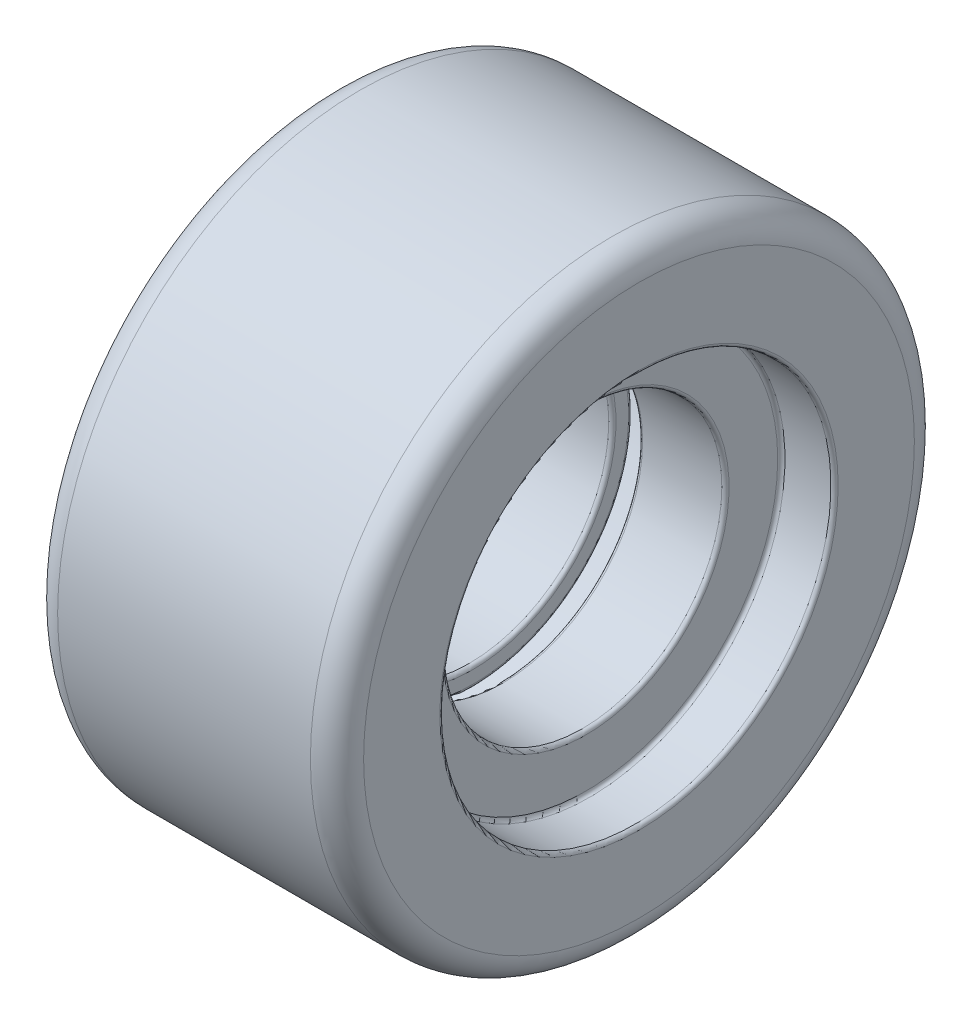
ISO-10303-21;
HEADER;
FILE_DESCRIPTION(('STEP AP214'),'2;1');
FILE_NAME('part.step','',(''),(''),'','','');
FILE_SCHEMA(('AUTOMOTIVE_DESIGN { 1 0 10303 214 1 1 1 1 }'));
ENDSEC;
DATA;
#1=APPLICATION_CONTEXT('core data for automotive mechanical design processes');
#2=APPLICATION_PROTOCOL_DEFINITION('international standard','automotive_design',2000,#1);
#3=PRODUCT_CONTEXT('',#1,'mechanical');
#4=PRODUCT('Part','Part','',(#3));
#5=PRODUCT_RELATED_PRODUCT_CATEGORY('part','',(#4));
#6=PRODUCT_DEFINITION_FORMATION('','',#4);
#7=PRODUCT_DEFINITION_CONTEXT('part definition',#1,'design');
#8=PRODUCT_DEFINITION('design','',#6,#7);
#9=PRODUCT_DEFINITION_SHAPE('','',#8);
#10=(LENGTH_UNIT() NAMED_UNIT(*) SI_UNIT(.MILLI.,.METRE.));
#11=(NAMED_UNIT(*) PLANE_ANGLE_UNIT() SI_UNIT($,.RADIAN.));
#12=(NAMED_UNIT(*) SI_UNIT($,.STERADIAN.) SOLID_ANGLE_UNIT());
#13=UNCERTAINTY_MEASURE_WITH_UNIT(LENGTH_MEASURE(1.E-05),#10,'distance_accuracy_value','');
#14=(GEOMETRIC_REPRESENTATION_CONTEXT(3) GLOBAL_UNCERTAINTY_ASSIGNED_CONTEXT((#13)) GLOBAL_UNIT_ASSIGNED_CONTEXT((#10,
#11,#12)) REPRESENTATION_CONTEXT('',''));
#15=CARTESIAN_POINT('',(0.,0.,0.));
#16=DIRECTION('',(0.,0.,1.));
#17=DIRECTION('',(1.,0.,0.));
#18=AXIS2_PLACEMENT_3D('',#15,#16,#17);
#19=CARTESIAN_POINT('',(-75.,107.714767554033,0.));
#20=DIRECTION('',(1.,0.,0.));
#21=DIRECTION('',(0.,0.,-1.));
#22=AXIS2_PLACEMENT_3D('',#19,#20,#21);
#23=PLANE('',#22);
#24=CARTESIAN_POINT('',(-75.,0.,0.));
#25=DIRECTION('',(-1.,0.,0.));
#26=DIRECTION('',(0.,0.,1.));
#27=AXIS2_PLACEMENT_3D('',#24,#25,#26);
#28=CIRCLE('',#27,107.714767554033);
#29=CARTESIAN_POINT('',(-75.,0.,107.714767554033));
#30=VERTEX_POINT('',#29);
#31=EDGE_CURVE('E10',#30,#30,#28,.T.);
#32=ORIENTED_EDGE('',*,*,#31,.F.);
#33=EDGE_LOOP('',(#32));
#34=FACE_BOUND('',#33,.T.);
#35=CARTESIAN_POINT('',(-75.,0.,0.));
#36=DIRECTION('',(-1.,0.,0.));
#37=DIRECTION('',(0.,0.,1.));
#38=AXIS2_PLACEMENT_3D('',#35,#36,#37);
#39=CIRCLE('',#38,147.);
#40=CARTESIAN_POINT('',(-75.,0.,147.));
#41=VERTEX_POINT('',#40);
#42=EDGE_CURVE('E156',#41,#41,#39,.T.);
#43=ORIENTED_EDGE('',*,*,#42,.T.);
#44=EDGE_LOOP('',(#43));
#45=FACE_BOUND('',#44,.T.);
#46=ADVANCED_FACE('F35',(#34,#45),#23,.F.);
#47=CARTESIAN_POINT('',(-72.2852324459665,0.,0.));
#48=DIRECTION('',(-1.,0.,0.));
#49=DIRECTION('',(0.,0.,1.));
#50=AXIS2_PLACEMENT_3D('',#47,#48,#49);
#51=TOROIDAL_SURFACE('',#50,107.714767554033,2.71476755403345);
#52=CARTESIAN_POINT('',(-72.2852324459665,0.,0.));
#53=DIRECTION('',(-1.,0.,0.));
#54=DIRECTION('',(0.,0.,1.));
#55=AXIS2_PLACEMENT_3D('',#52,#53,#54);
#56=CIRCLE('',#55,105.);
#57=CARTESIAN_POINT('',(-72.2852324459665,0.,105.));
#58=VERTEX_POINT('',#57);
#59=EDGE_CURVE('E41',#58,#58,#56,.T.);
#60=ORIENTED_EDGE('',*,*,#59,.F.);
#61=EDGE_LOOP('',(#60));
#62=FACE_BOUND('',#61,.T.);
#63=ORIENTED_EDGE('',*,*,#31,.T.);
#64=EDGE_LOOP('',(#63));
#65=FACE_BOUND('',#64,.T.);
#66=ADVANCED_FACE('F379',(#62,#65),#51,.T.);
#67=CARTESIAN_POINT('',(-91.3698630136986,0.,0.));
#68=DIRECTION('',(-1.,0.,0.));
#69=DIRECTION('',(0.,0.,1.));
#70=AXIS2_PLACEMENT_3D('',#67,#68,#69);
#71=CYLINDRICAL_SURFACE('',#70,105.);
#72=CARTESIAN_POINT('',(-12.7147675540335,0.,0.));
#73=DIRECTION('',(-1.,0.,0.));
#74=DIRECTION('',(0.,0.,1.));
#75=AXIS2_PLACEMENT_3D('',#72,#73,#74);
#76=CIRCLE('',#75,105.);
#77=CARTESIAN_POINT('',(-12.7147675540335,0.,105.));
#78=VERTEX_POINT('',#77);
#79=EDGE_CURVE('E45',#78,#78,#76,.T.);
#80=ORIENTED_EDGE('',*,*,#79,.F.);
#81=EDGE_LOOP('',(#80));
#82=FACE_BOUND('',#81,.T.);
#83=ORIENTED_EDGE('',*,*,#59,.T.);
#84=EDGE_LOOP('',(#83));
#85=FACE_BOUND('',#84,.T.);
#86=ADVANCED_FACE('F374',(#82,#85),#71,.F.);
#87=CARTESIAN_POINT('',(-12.7147675540335,0.,0.));
#88=DIRECTION('',(-1.,0.,0.));
#89=DIRECTION('',(0.,0.,1.));
#90=AXIS2_PLACEMENT_3D('',#87,#88,#89);
#91=TOROIDAL_SURFACE('',#90,107.714767554033,2.71476755403345);
#92=CARTESIAN_POINT('',(-9.99999999999999,0.,0.));
#93=DIRECTION('',(-1.,0.,0.));
#94=DIRECTION('',(0.,0.,1.));
#95=AXIS2_PLACEMENT_3D('',#92,#93,#94);
#96=CIRCLE('',#95,107.714767554033);
#97=CARTESIAN_POINT('',(-9.99999999999999,0.,107.714767554033));
#98=VERTEX_POINT('',#97);
#99=EDGE_CURVE('E49',#98,#98,#96,.T.);
#100=ORIENTED_EDGE('',*,*,#99,.F.);
#101=EDGE_LOOP('',(#100));
#102=FACE_BOUND('',#101,.T.);
#103=ORIENTED_EDGE('',*,*,#79,.T.);
#104=EDGE_LOOP('',(#103));
#105=FACE_BOUND('',#104,.T.);
#106=ADVANCED_FACE('F368',(#102,#105),#91,.T.);
#107=CARTESIAN_POINT('',(-9.99999999999999,117.285232445967,0.));
#108=DIRECTION('',(-1.,0.,0.));
#109=DIRECTION('',(0.,0.,1.));
#110=AXIS2_PLACEMENT_3D('',#107,#108,#109);
#111=PLANE('',#110);
#112=CARTESIAN_POINT('',(-9.99999999999999,0.,0.));
#113=DIRECTION('',(-1.,0.,0.));
#114=DIRECTION('',(0.,0.,1.));
#115=AXIS2_PLACEMENT_3D('',#112,#113,#114);
#116=CIRCLE('',#115,117.285232445967);
#117=CARTESIAN_POINT('',(-9.99999999999999,0.,117.285232445967));
#118=VERTEX_POINT('',#117);
#119=EDGE_CURVE('E54',#118,#118,#116,.T.);
#120=ORIENTED_EDGE('',*,*,#119,.F.);
#121=EDGE_LOOP('',(#120));
#122=FACE_BOUND('',#121,.T.);
#123=ORIENTED_EDGE('',*,*,#99,.T.);
#124=EDGE_LOOP('',(#123));
#125=FACE_BOUND('',#124,.T.);
#126=ADVANCED_FACE('F362',(#122,#125),#111,.F.);
#127=CARTESIAN_POINT('',(-12.7147675540335,0.,0.));
#128=DIRECTION('',(-1.,0.,0.));
#129=DIRECTION('',(0.,0.,1.));
#130=AXIS2_PLACEMENT_3D('',#127,#128,#129);
#131=TOROIDAL_SURFACE('',#130,117.285232445967,2.71476755403345);
#132=CARTESIAN_POINT('',(-12.7147675540335,0.,0.));
#133=DIRECTION('',(-1.,0.,0.));
#134=DIRECTION('',(0.,0.,1.));
#135=AXIS2_PLACEMENT_3D('',#132,#133,#134);
#136=CIRCLE('',#135,120.);
#137=CARTESIAN_POINT('',(-12.7147675540335,0.,120.));
#138=VERTEX_POINT('',#137);
#139=EDGE_CURVE('E57',#138,#138,#136,.T.);
#140=ORIENTED_EDGE('',*,*,#139,.F.);
#141=EDGE_LOOP('',(#140));
#142=FACE_BOUND('',#141,.T.);
#143=ORIENTED_EDGE('',*,*,#119,.T.);
#144=EDGE_LOOP('',(#143));
#145=FACE_BOUND('',#144,.T.);
#146=ADVANCED_FACE('F356',(#142,#145),#131,.T.);
#147=CARTESIAN_POINT('',(-91.3698630136986,0.,0.));
#148=DIRECTION('',(-1.,0.,0.));
#149=DIRECTION('',(0.,0.,1.));
#150=AXIS2_PLACEMENT_3D('',#147,#148,#149);
#151=CYLINDRICAL_SURFACE('',#150,120.);
#152=CARTESIAN_POINT('',(-57.2852324459665,0.,0.));
#153=DIRECTION('',(-1.,0.,0.));
#154=DIRECTION('',(0.,0.,1.));
#155=AXIS2_PLACEMENT_3D('',#152,#153,#154);
#156=CIRCLE('',#155,120.);
#157=CARTESIAN_POINT('',(-57.2852324459665,0.,120.));
#158=VERTEX_POINT('',#157);
#159=EDGE_CURVE('E60',#158,#158,#156,.T.);
#160=ORIENTED_EDGE('',*,*,#159,.F.);
#161=EDGE_LOOP('',(#160));
#162=FACE_BOUND('',#161,.T.);
#163=ORIENTED_EDGE('',*,*,#139,.T.);
#164=EDGE_LOOP('',(#163));
#165=FACE_BOUND('',#164,.T.);
#166=ADVANCED_FACE('F350',(#162,#165),#151,.T.);
#167=CARTESIAN_POINT('',(-57.2852324459665,0.,0.));
#168=DIRECTION('',(-1.,0.,0.));
#169=DIRECTION('',(0.,0.,1.));
#170=AXIS2_PLACEMENT_3D('',#167,#168,#169);
#171=TOROIDAL_SURFACE('',#170,122.714767554033,2.71476755403345);
#172=CARTESIAN_POINT('',(-60.,0.,0.));
#173=DIRECTION('',(-1.,0.,0.));
#174=DIRECTION('',(0.,0.,1.));
#175=AXIS2_PLACEMENT_3D('',#172,#173,#174);
#176=CIRCLE('',#175,122.714767554033);
#177=CARTESIAN_POINT('',(-60.,0.,122.714767554033));
#178=VERTEX_POINT('',#177);
#179=EDGE_CURVE('E63',#178,#178,#176,.T.);
#180=ORIENTED_EDGE('',*,*,#179,.F.);
#181=EDGE_LOOP('',(#180));
#182=FACE_BOUND('',#181,.T.);
#183=ORIENTED_EDGE('',*,*,#159,.T.);
#184=EDGE_LOOP('',(#183));
#185=FACE_BOUND('',#184,.T.);
#186=ADVANCED_FACE('F344',(#182,#185),#171,.F.);
#187=CARTESIAN_POINT('',(-60.,122.714767554033,0.));
#188=DIRECTION('',(-1.,0.,0.));
#189=DIRECTION('',(0.,0.,1.));
#190=AXIS2_PLACEMENT_3D('',#187,#188,#189);
#191=PLANE('',#190);
#192=CARTESIAN_POINT('',(-60.,0.,0.));
#193=DIRECTION('',(-1.,0.,0.));
#194=DIRECTION('',(0.,0.,1.));
#195=AXIS2_PLACEMENT_3D('',#192,#193,#194);
#196=CIRCLE('',#195,159.285232445967);
#197=CARTESIAN_POINT('',(-60.,0.,159.285232445967));
#198=VERTEX_POINT('',#197);
#199=EDGE_CURVE('E66',#198,#198,#196,.T.);
#200=ORIENTED_EDGE('',*,*,#199,.F.);
#201=EDGE_LOOP('',(#200));
#202=FACE_BOUND('',#201,.T.);
#203=ORIENTED_EDGE('',*,*,#179,.T.);
#204=EDGE_LOOP('',(#203));
#205=FACE_BOUND('',#204,.T.);
#206=ADVANCED_FACE('F338',(#202,#205),#191,.F.);
#207=CARTESIAN_POINT('',(-62.7147675540335,0.,0.));
#208=DIRECTION('',(-1.,0.,0.));
#209=DIRECTION('',(0.,0.,1.));
#210=AXIS2_PLACEMENT_3D('',#207,#208,#209);
#211=TOROIDAL_SURFACE('',#210,159.285232445967,2.71476755403346);
#212=CARTESIAN_POINT('',(-62.7147675540335,0.,0.));
#213=DIRECTION('',(-1.,0.,0.));
#214=DIRECTION('',(0.,0.,1.));
#215=AXIS2_PLACEMENT_3D('',#212,#213,#214);
#216=CIRCLE('',#215,162.);
#217=CARTESIAN_POINT('',(-62.7147675540335,0.,162.));
#218=VERTEX_POINT('',#217);
#219=EDGE_CURVE('E69',#218,#218,#216,.T.);
#220=ORIENTED_EDGE('',*,*,#219,.F.);
#221=EDGE_LOOP('',(#220));
#222=FACE_BOUND('',#221,.T.);
#223=ORIENTED_EDGE('',*,*,#199,.T.);
#224=EDGE_LOOP('',(#223));
#225=FACE_BOUND('',#224,.T.);
#226=ADVANCED_FACE('F332',(#222,#225),#211,.T.);
#227=CARTESIAN_POINT('',(-91.3698630136986,0.,0.));
#228=DIRECTION('',(-1.,0.,0.));
#229=DIRECTION('',(0.,0.,1.));
#230=AXIS2_PLACEMENT_3D('',#227,#228,#229);
#231=CYLINDRICAL_SURFACE('',#230,162.);
#232=CARTESIAN_POINT('',(-97.2852324459665,0.,0.));
#233=DIRECTION('',(-1.,0.,0.));
#234=DIRECTION('',(0.,0.,1.));
#235=AXIS2_PLACEMENT_3D('',#232,#233,#234);
#236=CIRCLE('',#235,162.);
#237=CARTESIAN_POINT('',(-97.2852324459665,0.,162.));
#238=VERTEX_POINT('',#237);
#239=EDGE_CURVE('E72',#238,#238,#236,.T.);
#240=ORIENTED_EDGE('',*,*,#239,.F.);
#241=EDGE_LOOP('',(#240));
#242=FACE_BOUND('',#241,.T.);
#243=ORIENTED_EDGE('',*,*,#219,.T.);
#244=EDGE_LOOP('',(#243));
#245=FACE_BOUND('',#244,.T.);
#246=ADVANCED_FACE('F326',(#242,#245),#231,.T.);
#247=CARTESIAN_POINT('',(-97.2852324459666,0.,0.));
#248=DIRECTION('',(-1.,0.,0.));
#249=DIRECTION('',(0.,0.,1.));
#250=AXIS2_PLACEMENT_3D('',#247,#248,#249);
#251=TOROIDAL_SURFACE('',#250,164.714767554033,2.71476755403346);
#252=CARTESIAN_POINT('',(-100.,0.,0.));
#253=DIRECTION('',(-1.,0.,0.));
#254=DIRECTION('',(0.,0.,1.));
#255=AXIS2_PLACEMENT_3D('',#252,#253,#254);
#256=CIRCLE('',#255,164.714767554033);
#257=CARTESIAN_POINT('',(-100.,0.,164.714767554033));
#258=VERTEX_POINT('',#257);
#259=EDGE_CURVE('E75',#258,#258,#256,.T.);
#260=ORIENTED_EDGE('',*,*,#259,.F.);
#261=EDGE_LOOP('',(#260));
#262=FACE_BOUND('',#261,.T.);
#263=ORIENTED_EDGE('',*,*,#239,.T.);
#264=EDGE_LOOP('',(#263));
#265=FACE_BOUND('',#264,.T.);
#266=ADVANCED_FACE('F320',(#262,#265),#251,.F.);
#267=CARTESIAN_POINT('',(-100.,164.714767554033,0.));
#268=DIRECTION('',(-1.,0.,0.));
#269=DIRECTION('',(0.,0.,1.));
#270=AXIS2_PLACEMENT_3D('',#267,#268,#269);
#271=PLANE('',#270);
#272=CARTESIAN_POINT('',(-100.,0.,0.));
#273=DIRECTION('',(-1.,0.,0.));
#274=DIRECTION('',(0.,0.,1.));
#275=AXIS2_PLACEMENT_3D('',#272,#273,#274);
#276=CIRCLE('',#275,209.285232445967);
#277=CARTESIAN_POINT('',(-100.,0.,209.285232445967));
#278=VERTEX_POINT('',#277);
#279=EDGE_CURVE('E78',#278,#278,#276,.T.);
#280=ORIENTED_EDGE('',*,*,#279,.F.);
#281=EDGE_LOOP('',(#280));
#282=FACE_BOUND('',#281,.T.);
#283=ORIENTED_EDGE('',*,*,#259,.T.);
#284=EDGE_LOOP('',(#283));
#285=FACE_BOUND('',#284,.T.);
#286=ADVANCED_FACE('F314',(#282,#285),#271,.F.);
#287=CARTESIAN_POINT('',(-97.2852324459666,0.,0.));
#288=DIRECTION('',(-1.,0.,0.));
#289=DIRECTION('',(0.,0.,1.));
#290=AXIS2_PLACEMENT_3D('',#287,#288,#289);
#291=TOROIDAL_SURFACE('',#290,209.285232445967,2.71476755403346);
#292=CARTESIAN_POINT('',(-97.2852324459665,0.,0.));
#293=DIRECTION('',(-1.,0.,0.));
#294=DIRECTION('',(0.,0.,1.));
#295=AXIS2_PLACEMENT_3D('',#292,#293,#294);
#296=CIRCLE('',#295,212.);
#297=CARTESIAN_POINT('',(-97.2852324459665,0.,212.));
#298=VERTEX_POINT('',#297);
#299=EDGE_CURVE('E81',#298,#298,#296,.T.);
#300=ORIENTED_EDGE('',*,*,#299,.F.);
#301=EDGE_LOOP('',(#300));
#302=FACE_BOUND('',#301,.T.);
#303=ORIENTED_EDGE('',*,*,#279,.T.);
#304=EDGE_LOOP('',(#303));
#305=FACE_BOUND('',#304,.T.);
#306=ADVANCED_FACE('F308',(#302,#305),#291,.F.);
#307=CARTESIAN_POINT('',(-91.3698630136986,0.,0.));
#308=DIRECTION('',(-1.,0.,0.));
#309=DIRECTION('',(0.,0.,1.));
#310=AXIS2_PLACEMENT_3D('',#307,#308,#309);
#311=CYLINDRICAL_SURFACE('',#310,212.);
#312=CARTESIAN_POINT('',(97.2852324459665,0.,0.));
#313=DIRECTION('',(-1.,0.,0.));
#314=DIRECTION('',(0.,0.,1.));
#315=AXIS2_PLACEMENT_3D('',#312,#313,#314);
#316=CIRCLE('',#315,212.);
#317=CARTESIAN_POINT('',(97.2852324459665,0.,212.));
#318=VERTEX_POINT('',#317);
#319=EDGE_CURVE('E84',#318,#318,#316,.T.);
#320=ORIENTED_EDGE('',*,*,#319,.F.);
#321=EDGE_LOOP('',(#320));
#322=FACE_BOUND('',#321,.T.);
#323=ORIENTED_EDGE('',*,*,#299,.T.);
#324=EDGE_LOOP('',(#323));
#325=FACE_BOUND('',#324,.T.);
#326=ADVANCED_FACE('F302',(#322,#325),#311,.F.);
#327=CARTESIAN_POINT('',(97.2852324459666,0.,0.));
#328=DIRECTION('',(-1.,0.,0.));
#329=DIRECTION('',(0.,0.,1.));
#330=AXIS2_PLACEMENT_3D('',#327,#328,#329);
#331=TOROIDAL_SURFACE('',#330,209.285232445967,2.71476755403346);
#332=CARTESIAN_POINT('',(100.,0.,0.));
#333=DIRECTION('',(-1.,0.,0.));
#334=DIRECTION('',(0.,0.,1.));
#335=AXIS2_PLACEMENT_3D('',#332,#333,#334);
#336=CIRCLE('',#335,209.285232445967);
#337=CARTESIAN_POINT('',(100.,0.,209.285232445967));
#338=VERTEX_POINT('',#337);
#339=EDGE_CURVE('E87',#338,#338,#336,.T.);
#340=ORIENTED_EDGE('',*,*,#339,.F.);
#341=EDGE_LOOP('',(#340));
#342=FACE_BOUND('',#341,.T.);
#343=ORIENTED_EDGE('',*,*,#319,.T.);
#344=EDGE_LOOP('',(#343));
#345=FACE_BOUND('',#344,.T.);
#346=ADVANCED_FACE('F296',(#342,#345),#331,.F.);
#347=CARTESIAN_POINT('',(100.,164.714767554033,0.));
#348=DIRECTION('',(1.,0.,0.));
#349=DIRECTION('',(0.,0.,-1.));
#350=AXIS2_PLACEMENT_3D('',#347,#348,#349);
#351=PLANE('',#350);
#352=CARTESIAN_POINT('',(100.,0.,0.));
#353=DIRECTION('',(-1.,0.,0.));
#354=DIRECTION('',(0.,0.,1.));
#355=AXIS2_PLACEMENT_3D('',#352,#353,#354);
#356=CIRCLE('',#355,164.714767554033);
#357=CARTESIAN_POINT('',(100.,0.,164.714767554033));
#358=VERTEX_POINT('',#357);
#359=EDGE_CURVE('E90',#358,#358,#356,.T.);
#360=ORIENTED_EDGE('',*,*,#359,.F.);
#361=EDGE_LOOP('',(#360));
#362=FACE_BOUND('',#361,.T.);
#363=ORIENTED_EDGE('',*,*,#339,.T.);
#364=EDGE_LOOP('',(#363));
#365=FACE_BOUND('',#364,.T.);
#366=ADVANCED_FACE('F290',(#362,#365),#351,.F.);
#367=CARTESIAN_POINT('',(97.2852324459666,0.,0.));
#368=DIRECTION('',(-1.,0.,0.));
#369=DIRECTION('',(0.,0.,1.));
#370=AXIS2_PLACEMENT_3D('',#367,#368,#369);
#371=TOROIDAL_SURFACE('',#370,164.714767554033,2.71476755403346);
#372=CARTESIAN_POINT('',(97.2852324459665,0.,0.));
#373=DIRECTION('',(-1.,0.,0.));
#374=DIRECTION('',(0.,0.,1.));
#375=AXIS2_PLACEMENT_3D('',#372,#373,#374);
#376=CIRCLE('',#375,162.);
#377=CARTESIAN_POINT('',(97.2852324459665,0.,162.));
#378=VERTEX_POINT('',#377);
#379=EDGE_CURVE('E93',#378,#378,#376,.T.);
#380=ORIENTED_EDGE('',*,*,#379,.F.);
#381=EDGE_LOOP('',(#380));
#382=FACE_BOUND('',#381,.T.);
#383=ORIENTED_EDGE('',*,*,#359,.T.);
#384=EDGE_LOOP('',(#383));
#385=FACE_BOUND('',#384,.T.);
#386=ADVANCED_FACE('F284',(#382,#385),#371,.F.);
#387=CARTESIAN_POINT('',(-91.3698630136986,0.,0.));
#388=DIRECTION('',(-1.,0.,0.));
#389=DIRECTION('',(0.,0.,1.));
#390=AXIS2_PLACEMENT_3D('',#387,#388,#389);
#391=CYLINDRICAL_SURFACE('',#390,162.);
#392=CARTESIAN_POINT('',(62.7147675540335,0.,0.));
#393=DIRECTION('',(-1.,0.,0.));
#394=DIRECTION('',(0.,0.,1.));
#395=AXIS2_PLACEMENT_3D('',#392,#393,#394);
#396=CIRCLE('',#395,162.);
#397=CARTESIAN_POINT('',(62.7147675540335,0.,162.));
#398=VERTEX_POINT('',#397);
#399=EDGE_CURVE('E96',#398,#398,#396,.T.);
#400=ORIENTED_EDGE('',*,*,#399,.F.);
#401=EDGE_LOOP('',(#400));
#402=FACE_BOUND('',#401,.T.);
#403=ORIENTED_EDGE('',*,*,#379,.T.);
#404=EDGE_LOOP('',(#403));
#405=FACE_BOUND('',#404,.T.);
#406=ADVANCED_FACE('F278',(#402,#405),#391,.T.);
#407=CARTESIAN_POINT('',(62.7147675540335,0.,0.));
#408=DIRECTION('',(-1.,0.,0.));
#409=DIRECTION('',(0.,0.,1.));
#410=AXIS2_PLACEMENT_3D('',#407,#408,#409);
#411=TOROIDAL_SURFACE('',#410,159.285232445967,2.71476755403346);
#412=CARTESIAN_POINT('',(60.,0.,0.));
#413=DIRECTION('',(-1.,0.,0.));
#414=DIRECTION('',(0.,0.,1.));
#415=AXIS2_PLACEMENT_3D('',#412,#413,#414);
#416=CIRCLE('',#415,159.285232445967);
#417=CARTESIAN_POINT('',(60.,0.,159.285232445967));
#418=VERTEX_POINT('',#417);
#419=EDGE_CURVE('E99',#418,#418,#416,.T.);
#420=ORIENTED_EDGE('',*,*,#419,.F.);
#421=EDGE_LOOP('',(#420));
#422=FACE_BOUND('',#421,.T.);
#423=ORIENTED_EDGE('',*,*,#399,.T.);
#424=EDGE_LOOP('',(#423));
#425=FACE_BOUND('',#424,.T.);
#426=ADVANCED_FACE('F272',(#422,#425),#411,.T.);
#427=CARTESIAN_POINT('',(60.,122.714767554033,0.));
#428=DIRECTION('',(1.,0.,0.));
#429=DIRECTION('',(0.,0.,-1.));
#430=AXIS2_PLACEMENT_3D('',#427,#428,#429);
#431=PLANE('',#430);
#432=CARTESIAN_POINT('',(60.,0.,0.));
#433=DIRECTION('',(-1.,0.,0.));
#434=DIRECTION('',(0.,0.,1.));
#435=AXIS2_PLACEMENT_3D('',#432,#433,#434);
#436=CIRCLE('',#435,122.714767554033);
#437=CARTESIAN_POINT('',(60.,0.,122.714767554033));
#438=VERTEX_POINT('',#437);
#439=EDGE_CURVE('E102',#438,#438,#436,.T.);
#440=ORIENTED_EDGE('',*,*,#439,.F.);
#441=EDGE_LOOP('',(#440));
#442=FACE_BOUND('',#441,.T.);
#443=ORIENTED_EDGE('',*,*,#419,.T.);
#444=EDGE_LOOP('',(#443));
#445=FACE_BOUND('',#444,.T.);
#446=ADVANCED_FACE('F266',(#442,#445),#431,.F.);
#447=CARTESIAN_POINT('',(57.2852324459665,0.,0.));
#448=DIRECTION('',(-1.,0.,0.));
#449=DIRECTION('',(0.,0.,1.));
#450=AXIS2_PLACEMENT_3D('',#447,#448,#449);
#451=TOROIDAL_SURFACE('',#450,122.714767554033,2.71476755403345);
#452=CARTESIAN_POINT('',(57.2852324459665,0.,0.));
#453=DIRECTION('',(-1.,0.,0.));
#454=DIRECTION('',(0.,0.,1.));
#455=AXIS2_PLACEMENT_3D('',#452,#453,#454);
#456=CIRCLE('',#455,120.);
#457=CARTESIAN_POINT('',(57.2852324459665,0.,120.));
#458=VERTEX_POINT('',#457);
#459=EDGE_CURVE('E105',#458,#458,#456,.T.);
#460=ORIENTED_EDGE('',*,*,#459,.F.);
#461=EDGE_LOOP('',(#460));
#462=FACE_BOUND('',#461,.T.);
#463=ORIENTED_EDGE('',*,*,#439,.T.);
#464=EDGE_LOOP('',(#463));
#465=FACE_BOUND('',#464,.T.);
#466=ADVANCED_FACE('F260',(#462,#465),#451,.F.);
#467=CARTESIAN_POINT('',(-91.3698630136986,0.,0.));
#468=DIRECTION('',(-1.,0.,0.));
#469=DIRECTION('',(0.,0.,1.));
#470=AXIS2_PLACEMENT_3D('',#467,#468,#469);
#471=CYLINDRICAL_SURFACE('',#470,120.);
#472=CARTESIAN_POINT('',(12.7147675540335,0.,0.));
#473=DIRECTION('',(-1.,0.,0.));
#474=DIRECTION('',(0.,0.,1.));
#475=AXIS2_PLACEMENT_3D('',#472,#473,#474);
#476=CIRCLE('',#475,120.);
#477=CARTESIAN_POINT('',(12.7147675540335,0.,120.));
#478=VERTEX_POINT('',#477);
#479=EDGE_CURVE('E108',#478,#478,#476,.T.);
#480=ORIENTED_EDGE('',*,*,#479,.F.);
#481=EDGE_LOOP('',(#480));
#482=FACE_BOUND('',#481,.T.);
#483=ORIENTED_EDGE('',*,*,#459,.T.);
#484=EDGE_LOOP('',(#483));
#485=FACE_BOUND('',#484,.T.);
#486=ADVANCED_FACE('F254',(#482,#485),#471,.T.);
#487=CARTESIAN_POINT('',(12.7147675540335,0.,0.));
#488=DIRECTION('',(-1.,0.,0.));
#489=DIRECTION('',(0.,0.,1.));
#490=AXIS2_PLACEMENT_3D('',#487,#488,#489);
#491=TOROIDAL_SURFACE('',#490,117.285232445967,2.71476755403345);
#492=CARTESIAN_POINT('',(9.99999999999999,0.,0.));
#493=DIRECTION('',(-1.,0.,0.));
#494=DIRECTION('',(0.,0.,1.));
#495=AXIS2_PLACEMENT_3D('',#492,#493,#494);
#496=CIRCLE('',#495,117.285232445967);
#497=CARTESIAN_POINT('',(9.99999999999999,0.,117.285232445967));
#498=VERTEX_POINT('',#497);
#499=EDGE_CURVE('E111',#498,#498,#496,.T.);
#500=ORIENTED_EDGE('',*,*,#499,.F.);
#501=EDGE_LOOP('',(#500));
#502=FACE_BOUND('',#501,.T.);
#503=ORIENTED_EDGE('',*,*,#479,.T.);
#504=EDGE_LOOP('',(#503));
#505=FACE_BOUND('',#504,.T.);
#506=ADVANCED_FACE('F248',(#502,#505),#491,.T.);
#507=CARTESIAN_POINT('',(9.99999999999999,117.285232445967,0.));
#508=DIRECTION('',(1.,0.,0.));
#509=DIRECTION('',(0.,0.,-1.));
#510=AXIS2_PLACEMENT_3D('',#507,#508,#509);
#511=PLANE('',#510);
#512=CARTESIAN_POINT('',(9.99999999999999,0.,0.));
#513=DIRECTION('',(-1.,0.,0.));
#514=DIRECTION('',(0.,0.,1.));
#515=AXIS2_PLACEMENT_3D('',#512,#513,#514);
#516=CIRCLE('',#515,107.714767554033);
#517=CARTESIAN_POINT('',(9.99999999999999,0.,107.714767554033));
#518=VERTEX_POINT('',#517);
#519=EDGE_CURVE('E114',#518,#518,#516,.T.);
#520=ORIENTED_EDGE('',*,*,#519,.F.);
#521=EDGE_LOOP('',(#520));
#522=FACE_BOUND('',#521,.T.);
#523=ORIENTED_EDGE('',*,*,#499,.T.);
#524=EDGE_LOOP('',(#523));
#525=FACE_BOUND('',#524,.T.);
#526=ADVANCED_FACE('F242',(#522,#525),#511,.F.);
#527=CARTESIAN_POINT('',(12.7147675540335,0.,0.));
#528=DIRECTION('',(-1.,0.,0.));
#529=DIRECTION('',(0.,0.,1.));
#530=AXIS2_PLACEMENT_3D('',#527,#528,#529);
#531=TOROIDAL_SURFACE('',#530,107.714767554033,2.71476755403345);
#532=CARTESIAN_POINT('',(12.7147675540335,0.,0.));
#533=DIRECTION('',(-1.,0.,0.));
#534=DIRECTION('',(0.,0.,1.));
#535=AXIS2_PLACEMENT_3D('',#532,#533,#534);
#536=CIRCLE('',#535,105.);
#537=CARTESIAN_POINT('',(12.7147675540335,0.,105.));
#538=VERTEX_POINT('',#537);
#539=EDGE_CURVE('E117',#538,#538,#536,.T.);
#540=ORIENTED_EDGE('',*,*,#539,.F.);
#541=EDGE_LOOP('',(#540));
#542=FACE_BOUND('',#541,.T.);
#543=ORIENTED_EDGE('',*,*,#519,.T.);
#544=EDGE_LOOP('',(#543));
#545=FACE_BOUND('',#544,.T.);
#546=ADVANCED_FACE('F236',(#542,#545),#531,.T.);
#547=CARTESIAN_POINT('',(-91.3698630136986,0.,0.));
#548=DIRECTION('',(-1.,0.,0.));
#549=DIRECTION('',(0.,0.,1.));
#550=AXIS2_PLACEMENT_3D('',#547,#548,#549);
#551=CYLINDRICAL_SURFACE('',#550,105.);
#552=CARTESIAN_POINT('',(72.2852324459665,0.,0.));
#553=DIRECTION('',(-1.,0.,0.));
#554=DIRECTION('',(0.,0.,1.));
#555=AXIS2_PLACEMENT_3D('',#552,#553,#554);
#556=CIRCLE('',#555,105.);
#557=CARTESIAN_POINT('',(72.2852324459665,0.,105.));
#558=VERTEX_POINT('',#557);
#559=EDGE_CURVE('E120',#558,#558,#556,.T.);
#560=ORIENTED_EDGE('',*,*,#559,.F.);
#561=EDGE_LOOP('',(#560));
#562=FACE_BOUND('',#561,.T.);
#563=ORIENTED_EDGE('',*,*,#539,.T.);
#564=EDGE_LOOP('',(#563));
#565=FACE_BOUND('',#564,.T.);
#566=ADVANCED_FACE('F230',(#562,#565),#551,.F.);
#567=CARTESIAN_POINT('',(72.2852324459665,0.,0.));
#568=DIRECTION('',(-1.,0.,0.));
#569=DIRECTION('',(0.,0.,1.));
#570=AXIS2_PLACEMENT_3D('',#567,#568,#569);
#571=TOROIDAL_SURFACE('',#570,107.714767554033,2.71476755403345);
#572=CARTESIAN_POINT('',(75.,0.,0.));
#573=DIRECTION('',(-1.,0.,0.));
#574=DIRECTION('',(0.,0.,1.));
#575=AXIS2_PLACEMENT_3D('',#572,#573,#574);
#576=CIRCLE('',#575,107.714767554033);
#577=CARTESIAN_POINT('',(75.,0.,107.714767554033));
#578=VERTEX_POINT('',#577);
#579=EDGE_CURVE('E123',#578,#578,#576,.T.);
#580=ORIENTED_EDGE('',*,*,#579,.F.);
#581=EDGE_LOOP('',(#580));
#582=FACE_BOUND('',#581,.T.);
#583=ORIENTED_EDGE('',*,*,#559,.T.);
#584=EDGE_LOOP('',(#583));
#585=FACE_BOUND('',#584,.T.);
#586=ADVANCED_FACE('F224',(#582,#585),#571,.T.);
#587=CARTESIAN_POINT('',(75.,107.714767554033,0.));
#588=DIRECTION('',(-1.,0.,0.));
#589=DIRECTION('',(0.,0.,1.));
#590=AXIS2_PLACEMENT_3D('',#587,#588,#589);
#591=PLANE('',#590);
#592=CARTESIAN_POINT('',(75.,0.,0.));
#593=DIRECTION('',(-1.,0.,0.));
#594=DIRECTION('',(0.,0.,1.));
#595=AXIS2_PLACEMENT_3D('',#592,#593,#594);
#596=CIRCLE('',#595,144.285232445967);
#597=CARTESIAN_POINT('',(75.,0.,144.285232445967));
#598=VERTEX_POINT('',#597);
#599=EDGE_CURVE('E126',#598,#598,#596,.T.);
#600=ORIENTED_EDGE('',*,*,#599,.F.);
#601=EDGE_LOOP('',(#600));
#602=FACE_BOUND('',#601,.T.);
#603=ORIENTED_EDGE('',*,*,#579,.T.);
#604=EDGE_LOOP('',(#603));
#605=FACE_BOUND('',#604,.T.);
#606=ADVANCED_FACE('F218',(#602,#605),#591,.F.);
#607=CARTESIAN_POINT('',(77.7147675540334,0.,0.));
#608=DIRECTION('',(-1.,0.,0.));
#609=DIRECTION('',(0.,0.,1.));
#610=AXIS2_PLACEMENT_3D('',#607,#608,#609);
#611=TOROIDAL_SURFACE('',#610,144.285232445967,2.71476755403346);
#612=CARTESIAN_POINT('',(77.7147675540335,0.,0.));
#613=DIRECTION('',(-1.,0.,0.));
#614=DIRECTION('',(0.,0.,1.));
#615=AXIS2_PLACEMENT_3D('',#612,#613,#614);
#616=CIRCLE('',#615,147.);
#617=CARTESIAN_POINT('',(77.7147675540335,0.,147.));
#618=VERTEX_POINT('',#617);
#619=EDGE_CURVE('E129',#618,#618,#616,.T.);
#620=ORIENTED_EDGE('',*,*,#619,.F.);
#621=EDGE_LOOP('',(#620));
#622=FACE_BOUND('',#621,.T.);
#623=ORIENTED_EDGE('',*,*,#599,.T.);
#624=EDGE_LOOP('',(#623));
#625=FACE_BOUND('',#624,.T.);
#626=ADVANCED_FACE('F212',(#622,#625),#611,.F.);
#627=CARTESIAN_POINT('',(-91.3698630136986,0.,0.));
#628=DIRECTION('',(-1.,0.,0.));
#629=DIRECTION('',(0.,0.,1.));
#630=AXIS2_PLACEMENT_3D('',#627,#628,#629);
#631=CYLINDRICAL_SURFACE('',#630,147.);
#632=CARTESIAN_POINT('',(112.285232445967,0.,0.));
#633=DIRECTION('',(-1.,0.,0.));
#634=DIRECTION('',(0.,0.,1.));
#635=AXIS2_PLACEMENT_3D('',#632,#633,#634);
#636=CIRCLE('',#635,147.);
#637=CARTESIAN_POINT('',(112.285232445967,0.,147.));
#638=VERTEX_POINT('',#637);
#639=EDGE_CURVE('E132',#638,#638,#636,.T.);
#640=ORIENTED_EDGE('',*,*,#639,.F.);
#641=EDGE_LOOP('',(#640));
#642=FACE_BOUND('',#641,.T.);
#643=ORIENTED_EDGE('',*,*,#619,.T.);
#644=EDGE_LOOP('',(#643));
#645=FACE_BOUND('',#644,.T.);
#646=ADVANCED_FACE('F206',(#642,#645),#631,.F.);
#647=CARTESIAN_POINT('',(112.285232445967,0.,0.));
#648=DIRECTION('',(-1.,0.,0.));
#649=DIRECTION('',(0.,0.,1.));
#650=AXIS2_PLACEMENT_3D('',#647,#648,#649);
#651=TOROIDAL_SURFACE('',#650,149.714767554033,2.71476755403346);
#652=CARTESIAN_POINT('',(115.,0.,0.));
#653=DIRECTION('',(-1.,0.,0.));
#654=DIRECTION('',(0.,0.,1.));
#655=AXIS2_PLACEMENT_3D('',#652,#653,#654);
#656=CIRCLE('',#655,149.714767554033);
#657=CARTESIAN_POINT('',(115.,0.,149.714767554033));
#658=VERTEX_POINT('',#657);
#659=EDGE_CURVE('E135',#658,#658,#656,.T.);
#660=ORIENTED_EDGE('',*,*,#659,.F.);
#661=EDGE_LOOP('',(#660));
#662=FACE_BOUND('',#661,.T.);
#663=ORIENTED_EDGE('',*,*,#639,.T.);
#664=EDGE_LOOP('',(#663));
#665=FACE_BOUND('',#664,.T.);
#666=ADVANCED_FACE('F200',(#662,#665),#651,.T.);
#667=CARTESIAN_POINT('',(115.,149.714767554033,0.));
#668=DIRECTION('',(-1.,0.,0.));
#669=DIRECTION('',(0.,0.,1.));
#670=AXIS2_PLACEMENT_3D('',#667,#668,#669);
#671=PLANE('',#670);
#672=CARTESIAN_POINT('',(115.,0.,0.));
#673=DIRECTION('',(-1.,0.,0.));
#674=DIRECTION('',(0.,0.,1.));
#675=AXIS2_PLACEMENT_3D('',#672,#673,#674);
#676=CIRCLE('',#675,207.);
#677=CARTESIAN_POINT('',(115.,0.,207.));
#678=VERTEX_POINT('',#677);
#679=EDGE_CURVE('E138',#678,#678,#676,.T.);
#680=ORIENTED_EDGE('',*,*,#679,.F.);
#681=EDGE_LOOP('',(#680));
#682=FACE_BOUND('',#681,.T.);
#683=ORIENTED_EDGE('',*,*,#659,.T.);
#684=EDGE_LOOP('',(#683));
#685=FACE_BOUND('',#684,.T.);
#686=ADVANCED_FACE('F194',(#682,#685),#671,.F.);
#687=CARTESIAN_POINT('',(95.,0.,0.));
#688=DIRECTION('',(-1.,0.,0.));
#689=DIRECTION('',(0.,0.,1.));
#690=AXIS2_PLACEMENT_3D('',#687,#688,#689);
#691=TOROIDAL_SURFACE('',#690,207.,20.);
#692=CARTESIAN_POINT('',(94.9999999999999,0.,0.));
#693=DIRECTION('',(-1.,0.,0.));
#694=DIRECTION('',(0.,0.,1.));
#695=AXIS2_PLACEMENT_3D('',#692,#693,#694);
#696=CIRCLE('',#695,227.);
#697=CARTESIAN_POINT('',(94.9999999999999,0.,227.));
#698=VERTEX_POINT('',#697);
#699=EDGE_CURVE('E141',#698,#698,#696,.T.);
#700=ORIENTED_EDGE('',*,*,#699,.F.);
#701=EDGE_LOOP('',(#700));
#702=FACE_BOUND('',#701,.T.);
#703=ORIENTED_EDGE('',*,*,#679,.T.);
#704=EDGE_LOOP('',(#703));
#705=FACE_BOUND('',#704,.T.);
#706=ADVANCED_FACE('F188',(#702,#705),#691,.T.);
#707=CARTESIAN_POINT('',(-91.3698630136986,0.,0.));
#708=DIRECTION('',(-1.,0.,0.));
#709=DIRECTION('',(0.,0.,1.));
#710=AXIS2_PLACEMENT_3D('',#707,#708,#709);
#711=CYLINDRICAL_SURFACE('',#710,227.);
#712=CARTESIAN_POINT('',(-94.9999999999999,0.,0.));
#713=DIRECTION('',(-1.,0.,0.));
#714=DIRECTION('',(0.,0.,1.));
#715=AXIS2_PLACEMENT_3D('',#712,#713,#714);
#716=CIRCLE('',#715,227.);
#717=CARTESIAN_POINT('',(-94.9999999999999,0.,227.));
#718=VERTEX_POINT('',#717);
#719=EDGE_CURVE('E144',#718,#718,#716,.T.);
#720=ORIENTED_EDGE('',*,*,#719,.F.);
#721=EDGE_LOOP('',(#720));
#722=FACE_BOUND('',#721,.T.);
#723=ORIENTED_EDGE('',*,*,#699,.T.);
#724=EDGE_LOOP('',(#723));
#725=FACE_BOUND('',#724,.T.);
#726=ADVANCED_FACE('F182',(#722,#725),#711,.T.);
#727=CARTESIAN_POINT('',(-95.,0.,0.));
#728=DIRECTION('',(-1.,0.,0.));
#729=DIRECTION('',(0.,0.,1.));
#730=AXIS2_PLACEMENT_3D('',#727,#728,#729);
#731=TOROIDAL_SURFACE('',#730,207.,20.);
#732=CARTESIAN_POINT('',(-115.,0.,0.));
#733=DIRECTION('',(-1.,0.,0.));
#734=DIRECTION('',(0.,0.,1.));
#735=AXIS2_PLACEMENT_3D('',#732,#733,#734);
#736=CIRCLE('',#735,207.);
#737=CARTESIAN_POINT('',(-115.,0.,207.));
#738=VERTEX_POINT('',#737);
#739=EDGE_CURVE('E147',#738,#738,#736,.T.);
#740=ORIENTED_EDGE('',*,*,#739,.F.);
#741=EDGE_LOOP('',(#740));
#742=FACE_BOUND('',#741,.T.);
#743=ORIENTED_EDGE('',*,*,#719,.T.);
#744=EDGE_LOOP('',(#743));
#745=FACE_BOUND('',#744,.T.);
#746=ADVANCED_FACE('F176',(#742,#745),#731,.T.);
#747=CARTESIAN_POINT('',(-115.,149.714767554033,0.));
#748=DIRECTION('',(1.,0.,0.));
#749=DIRECTION('',(0.,0.,-1.));
#750=AXIS2_PLACEMENT_3D('',#747,#748,#749);
#751=PLANE('',#750);
#752=CARTESIAN_POINT('',(-115.,0.,0.));
#753=DIRECTION('',(-1.,0.,0.));
#754=DIRECTION('',(0.,0.,1.));
#755=AXIS2_PLACEMENT_3D('',#752,#753,#754);
#756=CIRCLE('',#755,149.714767554033);
#757=CARTESIAN_POINT('',(-115.,0.,149.714767554033));
#758=VERTEX_POINT('',#757);
#759=EDGE_CURVE('E150',#758,#758,#756,.T.);
#760=ORIENTED_EDGE('',*,*,#759,.F.);
#761=EDGE_LOOP('',(#760));
#762=FACE_BOUND('',#761,.T.);
#763=ORIENTED_EDGE('',*,*,#739,.T.);
#764=EDGE_LOOP('',(#763));
#765=FACE_BOUND('',#764,.T.);
#766=ADVANCED_FACE('F170',(#762,#765),#751,.F.);
#767=CARTESIAN_POINT('',(-112.285232445967,0.,0.));
#768=DIRECTION('',(-1.,0.,0.));
#769=DIRECTION('',(0.,0.,1.));
#770=AXIS2_PLACEMENT_3D('',#767,#768,#769);
#771=TOROIDAL_SURFACE('',#770,149.714767554033,2.71476755403346);
#772=CARTESIAN_POINT('',(-112.285232445967,0.,0.));
#773=DIRECTION('',(-1.,0.,0.));
#774=DIRECTION('',(0.,0.,1.));
#775=AXIS2_PLACEMENT_3D('',#772,#773,#774);
#776=CIRCLE('',#775,147.);
#777=CARTESIAN_POINT('',(-112.285232445967,0.,147.));
#778=VERTEX_POINT('',#777);
#779=EDGE_CURVE('E153',#778,#778,#776,.T.);
#780=ORIENTED_EDGE('',*,*,#779,.F.);
#781=EDGE_LOOP('',(#780));
#782=FACE_BOUND('',#781,.T.);
#783=ORIENTED_EDGE('',*,*,#759,.T.);
#784=EDGE_LOOP('',(#783));
#785=FACE_BOUND('',#784,.T.);
#786=ADVANCED_FACE('F164',(#782,#785),#771,.T.);
#787=CARTESIAN_POINT('',(-91.3698630136986,0.,0.));
#788=DIRECTION('',(-1.,0.,0.));
#789=DIRECTION('',(0.,0.,1.));
#790=AXIS2_PLACEMENT_3D('',#787,#788,#789);
#791=CYLINDRICAL_SURFACE('',#790,147.);
#792=ORIENTED_EDGE('',*,*,#42,.F.);
#793=EDGE_LOOP('',(#792));
#794=FACE_BOUND('',#793,.T.);
#795=ORIENTED_EDGE('',*,*,#779,.T.);
#796=EDGE_LOOP('',(#795));
#797=FACE_BOUND('',#796,.T.);
#798=ADVANCED_FACE('F161',(#794,#797),#791,.F.);
#799=CLOSED_SHELL('',(#46,#66,#86,#106,#126,#146,#166,#186,#206,#226,#246,#266,#286,#306,#326,
#346,#366,#386,#406,#426,#446,#466,#486,#506,#526,#546,#566,#586,#606,#626,#646,#666,#686,#706,
#726,#746,#766,#786,#798));
#800=MANIFOLD_SOLID_BREP('B2',#799);
#801=ADVANCED_BREP_SHAPE_REPRESENTATION('',(#18,#800),#14);
#802=SHAPE_DEFINITION_REPRESENTATION(#9,#801);
ENDSEC;
END-ISO-10303-21;
